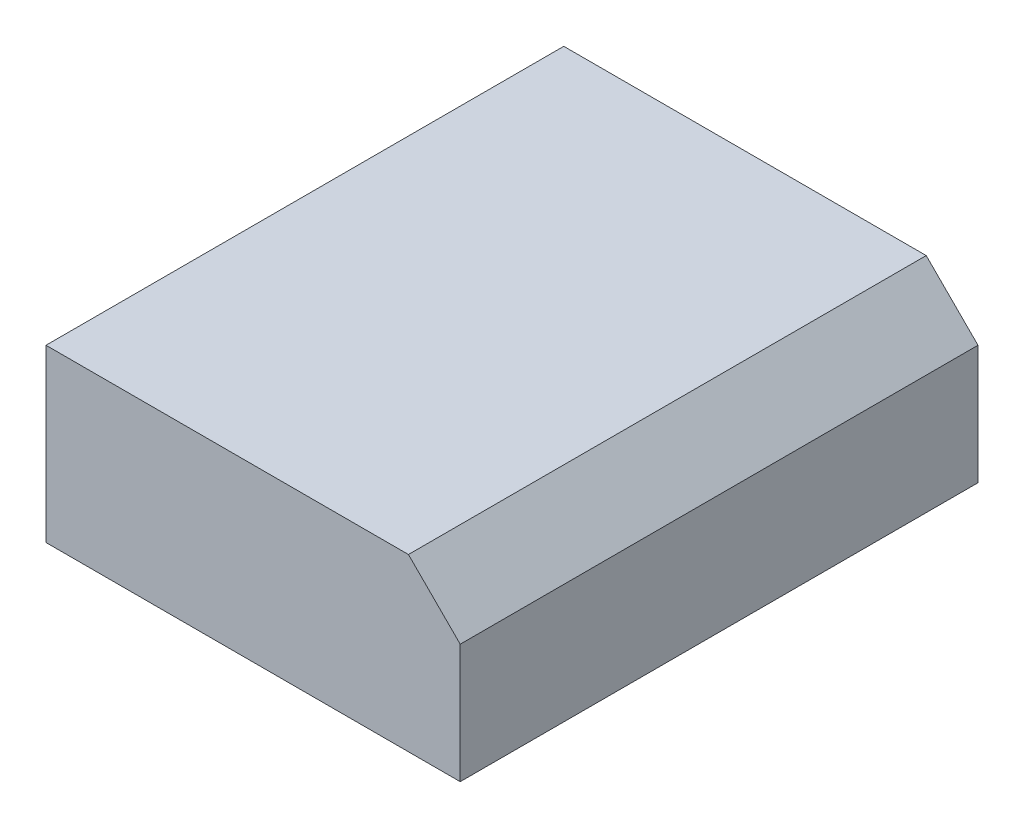
ISO-10303-21;
HEADER;
FILE_DESCRIPTION(('STEP AP214'),'2;1');
FILE_NAME('part.step','',(''),(''),'','','');
FILE_SCHEMA(('AUTOMOTIVE_DESIGN { 1 0 10303 214 1 1 1 1 }'));
ENDSEC;
DATA;
#1=APPLICATION_CONTEXT('core data for automotive mechanical design processes');
#2=APPLICATION_PROTOCOL_DEFINITION('international standard','automotive_design',2000,#1);
#3=PRODUCT_CONTEXT('',#1,'mechanical');
#4=PRODUCT('Part','Part','',(#3));
#5=PRODUCT_RELATED_PRODUCT_CATEGORY('part','',(#4));
#6=PRODUCT_DEFINITION_FORMATION('','',#4);
#7=PRODUCT_DEFINITION_CONTEXT('part definition',#1,'design');
#8=PRODUCT_DEFINITION('design','',#6,#7);
#9=PRODUCT_DEFINITION_SHAPE('','',#8);
#10=(LENGTH_UNIT() NAMED_UNIT(*) SI_UNIT(.MILLI.,.METRE.));
#11=(NAMED_UNIT(*) PLANE_ANGLE_UNIT() SI_UNIT($,.RADIAN.));
#12=(NAMED_UNIT(*) SI_UNIT($,.STERADIAN.) SOLID_ANGLE_UNIT());
#13=UNCERTAINTY_MEASURE_WITH_UNIT(LENGTH_MEASURE(1.E-05),#10,'distance_accuracy_value','');
#14=(GEOMETRIC_REPRESENTATION_CONTEXT(3) GLOBAL_UNCERTAINTY_ASSIGNED_CONTEXT((#13)) GLOBAL_UNIT_ASSIGNED_CONTEXT((#10,
#11,#12)) REPRESENTATION_CONTEXT('',''));
#15=CARTESIAN_POINT('',(0.,0.,0.));
#16=DIRECTION('',(0.,0.,1.));
#17=DIRECTION('',(1.,0.,0.));
#18=AXIS2_PLACEMENT_3D('',#15,#16,#17);
#19=CARTESIAN_POINT('',(1.205,0.1,1.55));
#20=DIRECTION('',(-1.,0.,0.));
#21=DIRECTION('',(0.,0.,1.));
#22=AXIS2_PLACEMENT_3D('',#19,#20,#21);
#23=PLANE('',#22);
#24=DIRECTION('',(0.,0.,-1.));
#25=VECTOR('',#24,1.);
#26=CARTESIAN_POINT('',(1.205,0.,1.55));
#27=LINE('',#26,#25);
#28=CARTESIAN_POINT('',(1.205,0.,1.55));
#29=VERTEX_POINT('',#28);
#30=CARTESIAN_POINT('',(1.205,0.,-1.55));
#31=VERTEX_POINT('',#30);
#32=EDGE_CURVE('E107',#29,#31,#27,.T.);
#33=ORIENTED_EDGE('',*,*,#32,.T.);
#34=DIRECTION('',(0.,-1.,0.));
#35=VECTOR('',#34,1.);
#36=CARTESIAN_POINT('',(1.205,0.1,-1.55));
#37=LINE('',#36,#35);
#38=CARTESIAN_POINT('',(1.205,0.1,-1.55));
#39=VERTEX_POINT('',#38);
#40=EDGE_CURVE('E12',#39,#31,#37,.T.);
#41=ORIENTED_EDGE('',*,*,#40,.F.);
#42=DIRECTION('',(0.,0.,-1.));
#43=VECTOR('',#42,1.);
#44=CARTESIAN_POINT('',(1.205,0.1,1.55));
#45=LINE('',#44,#43);
#46=CARTESIAN_POINT('',(1.205,0.1,1.55));
#47=VERTEX_POINT('',#46);
#48=EDGE_CURVE('E95',#47,#39,#45,.T.);
#49=ORIENTED_EDGE('',*,*,#48,.F.);
#50=DIRECTION('',(0.,-1.,0.));
#51=VECTOR('',#50,1.);
#52=CARTESIAN_POINT('',(1.205,0.1,1.55));
#53=LINE('',#52,#51);
#54=EDGE_CURVE('E103',#47,#29,#53,.T.);
#55=ORIENTED_EDGE('',*,*,#54,.T.);
#56=EDGE_LOOP('',(#33,#41,#49,#55));
#57=FACE_BOUND('',#56,.T.);
#58=ADVANCED_FACE('F44',(#57),#23,.F.);
#59=CARTESIAN_POINT('',(-1.205,0.1,-1.55));
#60=DIRECTION('',(0.,0.,1.));
#61=DIRECTION('',(1.,0.,0.));
#62=AXIS2_PLACEMENT_3D('',#59,#60,#61);
#63=PLANE('',#62);
#64=DIRECTION('',(-1.,0.,0.));
#65=VECTOR('',#64,1.);
#66=CARTESIAN_POINT('',(-1.205,0.,-1.55));
#67=LINE('',#66,#65);
#68=CARTESIAN_POINT('',(-1.205,0.,-1.55));
#69=VERTEX_POINT('',#68);
#70=EDGE_CURVE('E99',#31,#69,#67,.T.);
#71=ORIENTED_EDGE('',*,*,#70,.T.);
#72=DIRECTION('',(0.,-1.,0.));
#73=VECTOR('',#72,1.);
#74=CARTESIAN_POINT('',(-1.205,0.1,-1.55));
#75=LINE('',#74,#73);
#76=CARTESIAN_POINT('',(-1.205,0.1,-1.55));
#77=VERTEX_POINT('',#76);
#78=EDGE_CURVE('E52',#77,#69,#75,.T.);
#79=ORIENTED_EDGE('',*,*,#78,.F.);
#80=DIRECTION('',(-1.,0.,0.));
#81=VECTOR('',#80,1.);
#82=CARTESIAN_POINT('',(-1.205,0.1,-1.55));
#83=LINE('',#82,#81);
#84=EDGE_CURVE('E90',#39,#77,#83,.T.);
#85=ORIENTED_EDGE('',*,*,#84,.F.);
#86=ORIENTED_EDGE('',*,*,#40,.T.);
#87=EDGE_LOOP('',(#71,#79,#85,#86));
#88=FACE_BOUND('',#87,.T.);
#89=ADVANCED_FACE('F98',(#88),#63,.F.);
#90=CARTESIAN_POINT('',(-1.205,0.1,1.55));
#91=DIRECTION('',(1.,0.,0.));
#92=DIRECTION('',(0.,0.,-1.));
#93=AXIS2_PLACEMENT_3D('',#90,#91,#92);
#94=PLANE('',#93);
#95=DIRECTION('',(0.,0.,1.));
#96=VECTOR('',#95,1.);
#97=CARTESIAN_POINT('',(-1.205,0.,1.55));
#98=LINE('',#97,#96);
#99=CARTESIAN_POINT('',(-1.205,0.,1.55));
#100=VERTEX_POINT('',#99);
#101=EDGE_CURVE('E77',#69,#100,#98,.T.);
#102=ORIENTED_EDGE('',*,*,#101,.T.);
#103=DIRECTION('',(0.,-1.,0.));
#104=VECTOR('',#103,1.);
#105=CARTESIAN_POINT('',(-1.205,0.1,1.55));
#106=LINE('',#105,#104);
#107=CARTESIAN_POINT('',(-1.205,0.1,1.55));
#108=VERTEX_POINT('',#107);
#109=EDGE_CURVE('E100',#108,#100,#106,.T.);
#110=ORIENTED_EDGE('',*,*,#109,.F.);
#111=DIRECTION('',(0.,0.,1.));
#112=VECTOR('',#111,1.);
#113=CARTESIAN_POINT('',(-1.205,0.1,1.55));
#114=LINE('',#113,#112);
#115=EDGE_CURVE('E93',#77,#108,#114,.T.);
#116=ORIENTED_EDGE('',*,*,#115,.F.);
#117=ORIENTED_EDGE('',*,*,#78,.T.);
#118=EDGE_LOOP('',(#102,#110,#116,#117));
#119=FACE_BOUND('',#118,.T.);
#120=ADVANCED_FACE('F101',(#119),#94,.F.);
#121=CARTESIAN_POINT('',(-1.205,0.1,1.55));
#122=DIRECTION('',(0.,0.,-1.));
#123=DIRECTION('',(-1.,0.,0.));
#124=AXIS2_PLACEMENT_3D('',#121,#122,#123);
#125=PLANE('',#124);
#126=DIRECTION('',(1.,0.,0.));
#127=VECTOR('',#126,1.);
#128=CARTESIAN_POINT('',(-1.205,0.,1.55));
#129=LINE('',#128,#127);
#130=EDGE_CURVE('E83',#100,#29,#129,.T.);
#131=ORIENTED_EDGE('',*,*,#130,.T.);
#132=ORIENTED_EDGE('',*,*,#54,.F.);
#133=DIRECTION('',(1.,0.,0.));
#134=VECTOR('',#133,1.);
#135=CARTESIAN_POINT('',(-1.205,0.1,1.55));
#136=LINE('',#135,#134);
#137=EDGE_CURVE('E60',#108,#47,#136,.T.);
#138=ORIENTED_EDGE('',*,*,#137,.F.);
#139=ORIENTED_EDGE('',*,*,#109,.T.);
#140=EDGE_LOOP('',(#131,#132,#138,#139));
#141=FACE_BOUND('',#140,.T.);
#142=ADVANCED_FACE('F114',(#141),#125,.F.);
#143=CARTESIAN_POINT('',(1.205,0.1,-1.55));
#144=DIRECTION('',(0.,-1.,0.));
#145=DIRECTION('',(0.,0.,-1.));
#146=AXIS2_PLACEMENT_3D('',#143,#144,#145);
#147=PLANE('',#146);
#148=ORIENTED_EDGE('',*,*,#48,.T.);
#149=ORIENTED_EDGE('',*,*,#84,.T.);
#150=ORIENTED_EDGE('',*,*,#115,.T.);
#151=ORIENTED_EDGE('',*,*,#137,.T.);
#152=EDGE_LOOP('',(#148,#149,#150,#151));
#153=FACE_BOUND('',#152,.T.);
#154=ADVANCED_FACE('F91',(#153),#147,.F.);
#155=CARTESIAN_POINT('',(1.205,0.,-1.55));
#156=DIRECTION('',(0.,-1.,0.));
#157=DIRECTION('',(0.,0.,-1.));
#158=AXIS2_PLACEMENT_3D('',#155,#156,#157);
#159=PLANE('',#158);
#160=ORIENTED_EDGE('',*,*,#32,.F.);
#161=ORIENTED_EDGE('',*,*,#130,.F.);
#162=ORIENTED_EDGE('',*,*,#101,.F.);
#163=ORIENTED_EDGE('',*,*,#70,.F.);
#164=EDGE_LOOP('',(#160,#161,#162,#163));
#165=FACE_BOUND('',#164,.T.);
#166=ADVANCED_FACE('F117',(#165),#159,.T.);
#167=CLOSED_SHELL('',(#58,#89,#120,#142,#154,#166));
#168=MANIFOLD_SOLID_BREP('B2',#167);
#169=CARTESIAN_POINT('',(2.,1.75,2.5));
#170=DIRECTION('',(-1.,0.,0.));
#171=DIRECTION('',(0.,0.,1.));
#172=AXIS2_PLACEMENT_3D('',#169,#170,#171);
#173=PLANE('',#172);
#174=DIRECTION('',(0.,-1.,0.));
#175=VECTOR('',#174,1.);
#176=CARTESIAN_POINT('',(2.,1.75,-2.5));
#177=LINE('',#176,#175);
#178=CARTESIAN_POINT('',(2.,1.25,-2.5));
#179=VERTEX_POINT('',#178);
#180=CARTESIAN_POINT('',(2.,0.1,-2.5));
#181=VERTEX_POINT('',#180);
#182=EDGE_CURVE('E229',#179,#181,#177,.T.);
#183=ORIENTED_EDGE('',*,*,#182,.F.);
#184=DIRECTION('',(0.,0.,1.));
#185=VECTOR('',#184,1.);
#186=CARTESIAN_POINT('',(2.,1.25,2.5));
#187=LINE('',#186,#185);
#188=CARTESIAN_POINT('',(2.,1.25,2.5));
#189=VERTEX_POINT('',#188);
#190=EDGE_CURVE('E175',#179,#189,#187,.T.);
#191=ORIENTED_EDGE('',*,*,#190,.T.);
#192=DIRECTION('',(0.,-1.,0.));
#193=VECTOR('',#192,1.);
#194=CARTESIAN_POINT('',(2.,1.75,2.5));
#195=LINE('',#194,#193);
#196=CARTESIAN_POINT('',(2.,0.1,2.5));
#197=VERTEX_POINT('',#196);
#198=EDGE_CURVE('E237',#189,#197,#195,.T.);
#199=ORIENTED_EDGE('',*,*,#198,.T.);
#200=DIRECTION('',(0.,0.,-1.));
#201=VECTOR('',#200,1.);
#202=CARTESIAN_POINT('',(2.,0.1,2.5));
#203=LINE('',#202,#201);
#204=EDGE_CURVE('E240',#197,#181,#203,.T.);
#205=ORIENTED_EDGE('',*,*,#204,.T.);
#206=EDGE_LOOP('',(#183,#191,#199,#205));
#207=FACE_BOUND('',#206,.T.);
#208=ADVANCED_FACE('F167',(#207),#173,.F.);
#209=CARTESIAN_POINT('',(-2.,1.75,-2.5));
#210=DIRECTION('',(0.,0.,1.));
#211=DIRECTION('',(1.,0.,0.));
#212=AXIS2_PLACEMENT_3D('',#209,#210,#211);
#213=PLANE('',#212);
#214=DIRECTION('',(-1.,0.,0.));
#215=VECTOR('',#214,1.);
#216=CARTESIAN_POINT('',(-2.,1.75,-2.5));
#217=LINE('',#216,#215);
#218=CARTESIAN_POINT('',(1.5,1.75,-2.5));
#219=VERTEX_POINT('',#218);
#220=CARTESIAN_POINT('',(-2.,1.75,-2.5));
#221=VERTEX_POINT('',#220);
#222=EDGE_CURVE('E211',#219,#221,#217,.T.);
#223=ORIENTED_EDGE('',*,*,#222,.F.);
#224=DIRECTION('',(-0.707106781186546,0.707106781186549,0.));
#225=VECTOR('',#224,1.);
#226=CARTESIAN_POINT('',(1.5,1.75,-2.5));
#227=LINE('',#226,#225);
#228=EDGE_CURVE('E189',#219,#179,#227,.F.);
#229=ORIENTED_EDGE('',*,*,#228,.T.);
#230=ORIENTED_EDGE('',*,*,#182,.T.);
#231=DIRECTION('',(-1.,0.,0.));
#232=VECTOR('',#231,1.);
#233=CARTESIAN_POINT('',(-2.,0.1,-2.5));
#234=LINE('',#233,#232);
#235=CARTESIAN_POINT('',(-2.,0.1,-2.5));
#236=VERTEX_POINT('',#235);
#237=EDGE_CURVE('E226',#181,#236,#234,.T.);
#238=ORIENTED_EDGE('',*,*,#237,.T.);
#239=DIRECTION('',(0.,-1.,0.));
#240=VECTOR('',#239,1.);
#241=CARTESIAN_POINT('',(-2.,1.75,-2.5));
#242=LINE('',#241,#240);
#243=EDGE_CURVE('E223',#221,#236,#242,.T.);
#244=ORIENTED_EDGE('',*,*,#243,.F.);
#245=EDGE_LOOP('',(#223,#229,#230,#238,#244));
#246=FACE_BOUND('',#245,.T.);
#247=ADVANCED_FACE('F224',(#246),#213,.F.);
#248=CARTESIAN_POINT('',(-2.,1.75,2.5));
#249=DIRECTION('',(1.,0.,0.));
#250=DIRECTION('',(0.,0.,-1.));
#251=AXIS2_PLACEMENT_3D('',#248,#249,#250);
#252=PLANE('',#251);
#253=DIRECTION('',(0.,0.,1.));
#254=VECTOR('',#253,1.);
#255=CARTESIAN_POINT('',(-2.,0.1,2.5));
#256=LINE('',#255,#254);
#257=CARTESIAN_POINT('',(-2.,0.1,2.5));
#258=VERTEX_POINT('',#257);
#259=EDGE_CURVE('E244',#236,#258,#256,.T.);
#260=ORIENTED_EDGE('',*,*,#259,.T.);
#261=DIRECTION('',(0.,-1.,0.));
#262=VECTOR('',#261,1.);
#263=CARTESIAN_POINT('',(-2.,1.75,2.5));
#264=LINE('',#263,#262);
#265=CARTESIAN_POINT('',(-2.,1.75,2.5));
#266=VERTEX_POINT('',#265);
#267=EDGE_CURVE('E230',#266,#258,#264,.T.);
#268=ORIENTED_EDGE('',*,*,#267,.F.);
#269=DIRECTION('',(0.,0.,1.));
#270=VECTOR('',#269,1.);
#271=CARTESIAN_POINT('',(-2.,1.75,2.5));
#272=LINE('',#271,#270);
#273=EDGE_CURVE('E216',#221,#266,#272,.T.);
#274=ORIENTED_EDGE('',*,*,#273,.F.);
#275=ORIENTED_EDGE('',*,*,#243,.T.);
#276=EDGE_LOOP('',(#260,#268,#274,#275));
#277=FACE_BOUND('',#276,.T.);
#278=ADVANCED_FACE('F232',(#277),#252,.F.);
#279=CARTESIAN_POINT('',(-2.,1.75,2.5));
#280=DIRECTION('',(0.,0.,-1.));
#281=DIRECTION('',(-1.,0.,0.));
#282=AXIS2_PLACEMENT_3D('',#279,#280,#281);
#283=PLANE('',#282);
#284=ORIENTED_EDGE('',*,*,#198,.F.);
#285=DIRECTION('',(0.707106781186546,-0.707106781186549,0.));
#286=VECTOR('',#285,1.);
#287=CARTESIAN_POINT('',(1.5,1.75,2.5));
#288=LINE('',#287,#286);
#289=CARTESIAN_POINT('',(1.5,1.75,2.5));
#290=VERTEX_POINT('',#289);
#291=EDGE_CURVE('E42',#189,#290,#288,.F.);
#292=ORIENTED_EDGE('',*,*,#291,.T.);
#293=DIRECTION('',(1.,0.,0.));
#294=VECTOR('',#293,1.);
#295=CARTESIAN_POINT('',(-2.,1.75,2.5));
#296=LINE('',#295,#294);
#297=EDGE_CURVE('E235',#266,#290,#296,.T.);
#298=ORIENTED_EDGE('',*,*,#297,.F.);
#299=ORIENTED_EDGE('',*,*,#267,.T.);
#300=DIRECTION('',(1.,0.,0.));
#301=VECTOR('',#300,1.);
#302=CARTESIAN_POINT('',(-2.,0.1,2.5));
#303=LINE('',#302,#301);
#304=EDGE_CURVE('E220',#258,#197,#303,.T.);
#305=ORIENTED_EDGE('',*,*,#304,.T.);
#306=EDGE_LOOP('',(#284,#292,#298,#299,#305));
#307=FACE_BOUND('',#306,.T.);
#308=ADVANCED_FACE('F258',(#307),#283,.F.);
#309=CARTESIAN_POINT('',(2.,1.75,-2.5));
#310=DIRECTION('',(0.,-1.,0.));
#311=DIRECTION('',(0.,0.,-1.));
#312=AXIS2_PLACEMENT_3D('',#309,#310,#311);
#313=PLANE('',#312);
#314=ORIENTED_EDGE('',*,*,#297,.T.);
#315=DIRECTION('',(0.,0.,-1.));
#316=VECTOR('',#315,1.);
#317=CARTESIAN_POINT('',(1.5,1.75,-2.5));
#318=LINE('',#317,#316);
#319=EDGE_CURVE('E219',#290,#219,#318,.T.);
#320=ORIENTED_EDGE('',*,*,#319,.T.);
#321=ORIENTED_EDGE('',*,*,#222,.T.);
#322=ORIENTED_EDGE('',*,*,#273,.T.);
#323=EDGE_LOOP('',(#314,#320,#321,#322));
#324=FACE_BOUND('',#323,.T.);
#325=ADVANCED_FACE('F214',(#324),#313,.F.);
#326=CARTESIAN_POINT('',(2.,0.1,-2.5));
#327=DIRECTION('',(0.,-1.,0.));
#328=DIRECTION('',(0.,0.,-1.));
#329=AXIS2_PLACEMENT_3D('',#326,#327,#328);
#330=PLANE('',#329);
#331=ORIENTED_EDGE('',*,*,#204,.F.);
#332=ORIENTED_EDGE('',*,*,#304,.F.);
#333=ORIENTED_EDGE('',*,*,#259,.F.);
#334=ORIENTED_EDGE('',*,*,#237,.F.);
#335=EDGE_LOOP('',(#331,#332,#333,#334));
#336=FACE_BOUND('',#335,.T.);
#337=ADVANCED_FACE('F254',(#336),#330,.T.);
#338=CARTESIAN_POINT('',(1.5,1.75,-2.5));
#339=DIRECTION('',(-0.707106781186549,-0.707106781186546,0.));
#340=DIRECTION('',(0.707106781186546,-0.707106781186549,0.));
#341=AXIS2_PLACEMENT_3D('',#338,#339,#340);
#342=PLANE('',#341);
#343=ORIENTED_EDGE('',*,*,#291,.F.);
#344=ORIENTED_EDGE('',*,*,#190,.F.);
#345=ORIENTED_EDGE('',*,*,#228,.F.);
#346=ORIENTED_EDGE('',*,*,#319,.F.);
#347=EDGE_LOOP('',(#343,#344,#345,#346));
#348=FACE_BOUND('',#347,.T.);
#349=ADVANCED_FACE('F169',(#348),#342,.F.);
#350=CLOSED_SHELL('',(#208,#247,#278,#308,#325,#337,#349));
#351=MANIFOLD_SOLID_BREP('B6',#350);
#352=ADVANCED_BREP_SHAPE_REPRESENTATION('',(#18,#168,#351),#14);
#353=SHAPE_DEFINITION_REPRESENTATION(#9,#352);
ENDSEC;
END-ISO-10303-21;
